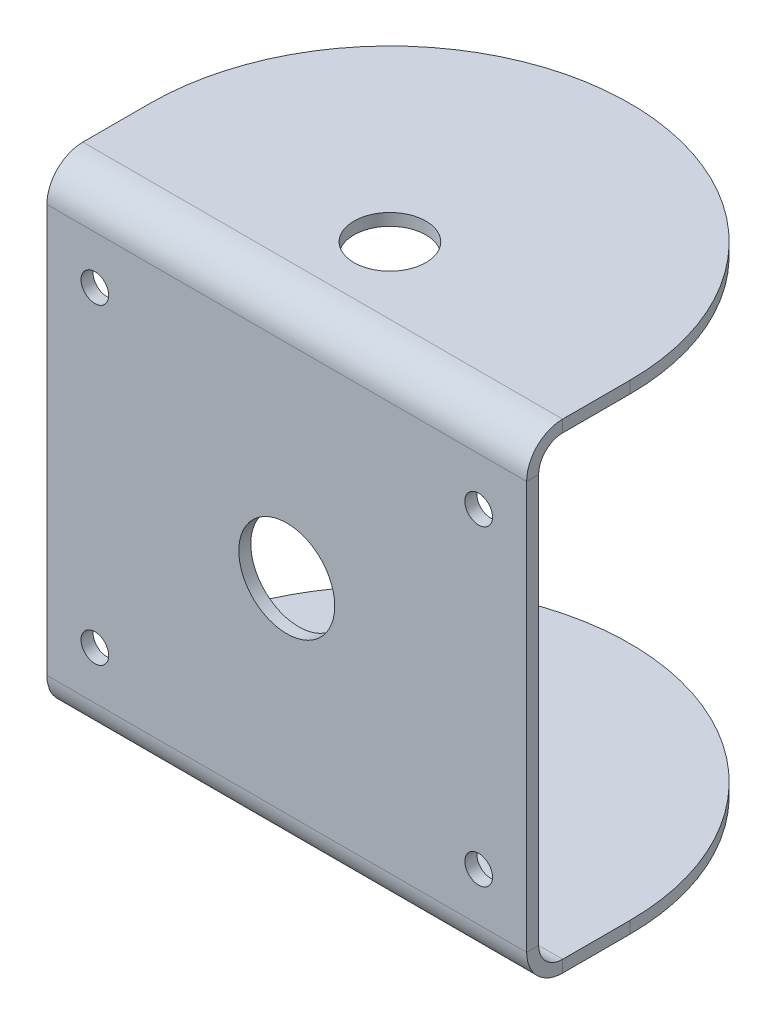
ISO-10303-21;
HEADER;
FILE_DESCRIPTION(('STEP AP214'),'2;1');
FILE_NAME('part.step','',(''),(''),'','','');
FILE_SCHEMA(('AUTOMOTIVE_DESIGN { 1 0 10303 214 1 1 1 1 }'));
ENDSEC;
DATA;
#1=APPLICATION_CONTEXT('core data for automotive mechanical design processes');
#2=APPLICATION_PROTOCOL_DEFINITION('international standard','automotive_design',2000,#1);
#3=PRODUCT_CONTEXT('',#1,'mechanical');
#4=PRODUCT('Part','Part','',(#3));
#5=PRODUCT_RELATED_PRODUCT_CATEGORY('part','',(#4));
#6=PRODUCT_DEFINITION_FORMATION('','',#4);
#7=PRODUCT_DEFINITION_CONTEXT('part definition',#1,'design');
#8=PRODUCT_DEFINITION('design','',#6,#7);
#9=PRODUCT_DEFINITION_SHAPE('','',#8);
#10=(LENGTH_UNIT() NAMED_UNIT(*) SI_UNIT(.MILLI.,.METRE.));
#11=(NAMED_UNIT(*) PLANE_ANGLE_UNIT() SI_UNIT($,.RADIAN.));
#12=(NAMED_UNIT(*) SI_UNIT($,.STERADIAN.) SOLID_ANGLE_UNIT());
#13=UNCERTAINTY_MEASURE_WITH_UNIT(LENGTH_MEASURE(1.E-05),#10,'distance_accuracy_value','');
#14=(GEOMETRIC_REPRESENTATION_CONTEXT(3) GLOBAL_UNCERTAINTY_ASSIGNED_CONTEXT((#13)) GLOBAL_UNIT_ASSIGNED_CONTEXT((#10,
#11,#12)) REPRESENTATION_CONTEXT('',''));
#15=CARTESIAN_POINT('',(0.,0.,0.));
#16=DIRECTION('',(0.,0.,1.));
#17=DIRECTION('',(1.,0.,0.));
#18=AXIS2_PLACEMENT_3D('',#15,#16,#17);
#19=CARTESIAN_POINT('',(-31.75,-26.9875,21.11375));
#20=DIRECTION('',(-1.,0.,0.));
#21=DIRECTION('',(0.,0.,1.));
#22=AXIS2_PLACEMENT_3D('',#19,#20,#21);
#23=PLANE('',#22);
#24=DIRECTION('',(0.,0.,1.));
#25=VECTOR('',#24,1.);
#26=CARTESIAN_POINT('',(-31.75,-30.1625,-22.70125));
#27=LINE('',#26,#25);
#28=CARTESIAN_POINT('',(-31.75,-30.1625,9.04875000000001));
#29=VERTEX_POINT('',#28);
#30=CARTESIAN_POINT('',(-31.75,-30.1625,17.93875));
#31=VERTEX_POINT('',#30);
#32=EDGE_CURVE('E170',#29,#31,#27,.T.);
#33=ORIENTED_EDGE('',*,*,#32,.F.);
#34=DIRECTION('',(0.,1.,0.));
#35=VECTOR('',#34,1.);
#36=CARTESIAN_POINT('',(-31.75,-95.25,9.04875000000001));
#37=LINE('',#36,#35);
#38=CARTESIAN_POINT('',(-31.75,-31.75,9.04875000000001));
#39=VERTEX_POINT('',#38);
#40=EDGE_CURVE('E148',#39,#29,#37,.T.);
#41=ORIENTED_EDGE('',*,*,#40,.F.);
#42=DIRECTION('',(0.,0.,1.));
#43=VECTOR('',#42,1.);
#44=CARTESIAN_POINT('',(-31.75,-31.75,-22.70125));
#45=LINE('',#44,#43);
#46=CARTESIAN_POINT('',(-31.75,-31.75,17.93875));
#47=VERTEX_POINT('',#46);
#48=EDGE_CURVE('E168',#39,#47,#45,.T.);
#49=ORIENTED_EDGE('',*,*,#48,.T.);
#50=DIRECTION('',(0.,1.,0.));
#51=VECTOR('',#50,1.);
#52=CARTESIAN_POINT('',(-31.75,-31.75,17.93875));
#53=LINE('',#52,#51);
#54=EDGE_CURVE('E215',#47,#31,#53,.T.);
#55=ORIENTED_EDGE('',*,*,#54,.T.);
#56=EDGE_LOOP('',(#33,#41,#49,#55));
#57=FACE_BOUND('',#56,.T.);
#58=ADVANCED_FACE('F43',(#57),#23,.T.);
#59=CARTESIAN_POINT('',(31.75,30.1625,22.70125));
#60=DIRECTION('',(0.,1.,0.));
#61=DIRECTION('',(0.,0.,1.));
#62=AXIS2_PLACEMENT_3D('',#59,#60,#61);
#63=PLANE('',#62);
#64=DIRECTION('',(0.,0.,1.));
#65=VECTOR('',#64,1.);
#66=CARTESIAN_POINT('',(-31.75,30.1625,22.70125));
#67=LINE('',#66,#65);
#68=CARTESIAN_POINT('',(-31.75,30.1625,17.93875));
#69=VERTEX_POINT('',#68);
#70=CARTESIAN_POINT('',(-31.75,30.1625,9.04875000000001));
#71=VERTEX_POINT('',#70);
#72=EDGE_CURVE('E155',#69,#71,#67,.F.);
#73=ORIENTED_EDGE('',*,*,#72,.T.);
#74=CARTESIAN_POINT('',(0.,30.1625,9.04875000000001));
#75=DIRECTION('',(0.,1.,0.));
#76=DIRECTION('',(0.,0.,1.));
#77=AXIS2_PLACEMENT_3D('',#74,#75,#76);
#78=CIRCLE('',#77,31.75);
#79=CARTESIAN_POINT('',(31.75,30.1625,9.04875));
#80=VERTEX_POINT('',#79);
#81=EDGE_CURVE('E68',#71,#80,#78,.F.);
#82=ORIENTED_EDGE('',*,*,#81,.T.);
#83=DIRECTION('',(0.,0.,1.));
#84=VECTOR('',#83,1.);
#85=CARTESIAN_POINT('',(31.75,30.1625,22.70125));
#86=LINE('',#85,#84);
#87=CARTESIAN_POINT('',(31.75,30.1625,17.93875));
#88=VERTEX_POINT('',#87);
#89=EDGE_CURVE('E181',#88,#80,#86,.F.);
#90=ORIENTED_EDGE('',*,*,#89,.F.);
#91=DIRECTION('',(-1.,0.,0.));
#92=VECTOR('',#91,1.);
#93=CARTESIAN_POINT('',(31.75,30.1625,17.93875));
#94=LINE('',#93,#92);
#95=EDGE_CURVE('E182',#88,#69,#94,.T.);
#96=ORIENTED_EDGE('',*,*,#95,.T.);
#97=EDGE_LOOP('',(#73,#82,#90,#96));
#98=FACE_BOUND('',#97,.T.);
#99=CARTESIAN_POINT('',(0.,30.1625,9.04875000000001));
#100=DIRECTION('',(0.,1.,0.));
#101=DIRECTION('',(0.,0.,1.));
#102=AXIS2_PLACEMENT_3D('',#99,#100,#101);
#103=CIRCLE('',#102,4.7625);
#104=CARTESIAN_POINT('',(0.,30.1625,13.81125));
#105=VERTEX_POINT('',#104);
#106=EDGE_CURVE('E159',#105,#105,#103,.T.);
#107=ORIENTED_EDGE('',*,*,#106,.T.);
#108=EDGE_LOOP('',(#107));
#109=FACE_BOUND('',#108,.T.);
#110=ADVANCED_FACE('F302',(#98,#109),#63,.F.);
#111=CARTESIAN_POINT('',(31.75,31.75,22.70125));
#112=DIRECTION('',(0.,1.,0.));
#113=DIRECTION('',(0.,0.,1.));
#114=AXIS2_PLACEMENT_3D('',#111,#112,#113);
#115=PLANE('',#114);
#116=CARTESIAN_POINT('',(0.,31.75,9.04875000000001));
#117=DIRECTION('',(0.,-1.,0.));
#118=DIRECTION('',(0.,0.,1.));
#119=AXIS2_PLACEMENT_3D('',#116,#117,#118);
#120=CIRCLE('',#119,31.75);
#121=CARTESIAN_POINT('',(-31.75,31.75,9.04875000000001));
#122=VERTEX_POINT('',#121);
#123=CARTESIAN_POINT('',(31.75,31.75,9.04875));
#124=VERTEX_POINT('',#123);
#125=EDGE_CURVE('E132',#122,#124,#120,.T.);
#126=ORIENTED_EDGE('',*,*,#125,.F.);
#127=DIRECTION('',(0.,0.,-1.));
#128=VECTOR('',#127,1.);
#129=CARTESIAN_POINT('',(-31.75,31.75,22.70125));
#130=LINE('',#129,#128);
#131=CARTESIAN_POINT('',(-31.75,31.75,17.93875));
#132=VERTEX_POINT('',#131);
#133=EDGE_CURVE('E144',#132,#122,#130,.T.);
#134=ORIENTED_EDGE('',*,*,#133,.F.);
#135=DIRECTION('',(-1.,0.,0.));
#136=VECTOR('',#135,1.);
#137=CARTESIAN_POINT('',(31.75,31.75,17.93875));
#138=LINE('',#137,#136);
#139=CARTESIAN_POINT('',(31.75,31.75,17.93875));
#140=VERTEX_POINT('',#139);
#141=EDGE_CURVE('E204',#140,#132,#138,.T.);
#142=ORIENTED_EDGE('',*,*,#141,.F.);
#143=DIRECTION('',(0.,0.,-1.));
#144=VECTOR('',#143,1.);
#145=CARTESIAN_POINT('',(31.75,31.75,22.70125));
#146=LINE('',#145,#144);
#147=EDGE_CURVE('E147',#140,#124,#146,.T.);
#148=ORIENTED_EDGE('',*,*,#147,.T.);
#149=EDGE_LOOP('',(#126,#134,#142,#148));
#150=FACE_BOUND('',#149,.T.);
#151=CARTESIAN_POINT('',(0.,31.75,9.04875000000001));
#152=DIRECTION('',(0.,1.,0.));
#153=DIRECTION('',(0.,0.,1.));
#154=AXIS2_PLACEMENT_3D('',#151,#152,#153);
#155=CIRCLE('',#154,4.7625);
#156=CARTESIAN_POINT('',(0.,31.75,13.81125));
#157=VERTEX_POINT('',#156);
#158=EDGE_CURVE('E149',#157,#157,#155,.T.);
#159=ORIENTED_EDGE('',*,*,#158,.F.);
#160=EDGE_LOOP('',(#159));
#161=FACE_BOUND('',#160,.T.);
#162=ADVANCED_FACE('F141',(#150,#161),#115,.T.);
#163=CARTESIAN_POINT('',(31.75,-31.75,-22.70125));
#164=DIRECTION('',(0.,-1.,0.));
#165=DIRECTION('',(0.,0.,-1.));
#166=AXIS2_PLACEMENT_3D('',#163,#164,#165);
#167=PLANE('',#166);
#168=ORIENTED_EDGE('',*,*,#48,.F.);
#169=CARTESIAN_POINT('',(0.,-31.75,9.04875000000001));
#170=DIRECTION('',(0.,-1.,0.));
#171=DIRECTION('',(0.,0.,-1.));
#172=AXIS2_PLACEMENT_3D('',#169,#170,#171);
#173=CIRCLE('',#172,31.75);
#174=CARTESIAN_POINT('',(31.75,-31.75,9.04875));
#175=VERTEX_POINT('',#174);
#176=EDGE_CURVE('E263',#175,#39,#173,.F.);
#177=ORIENTED_EDGE('',*,*,#176,.F.);
#178=DIRECTION('',(0.,0.,1.));
#179=VECTOR('',#178,1.);
#180=CARTESIAN_POINT('',(31.75,-31.75,-22.70125));
#181=LINE('',#180,#179);
#182=CARTESIAN_POINT('',(31.75,-31.75,17.93875));
#183=VERTEX_POINT('',#182);
#184=EDGE_CURVE('E282',#175,#183,#181,.T.);
#185=ORIENTED_EDGE('',*,*,#184,.T.);
#186=DIRECTION('',(-1.,0.,0.));
#187=VECTOR('',#186,1.);
#188=CARTESIAN_POINT('',(31.75,-31.75,17.93875));
#189=LINE('',#188,#187);
#190=EDGE_CURVE('E195',#183,#47,#189,.T.);
#191=ORIENTED_EDGE('',*,*,#190,.T.);
#192=EDGE_LOOP('',(#168,#177,#185,#191));
#193=FACE_BOUND('',#192,.T.);
#194=CARTESIAN_POINT('',(0.,-31.75,9.04875000000001));
#195=DIRECTION('',(0.,-1.,0.));
#196=DIRECTION('',(0.,0.,-1.));
#197=AXIS2_PLACEMENT_3D('',#194,#195,#196);
#198=CIRCLE('',#197,4.7625);
#199=CARTESIAN_POINT('',(0.,-31.75,4.28625000000001));
#200=VERTEX_POINT('',#199);
#201=EDGE_CURVE('E225',#200,#200,#198,.T.);
#202=ORIENTED_EDGE('',*,*,#201,.F.);
#203=EDGE_LOOP('',(#202));
#204=FACE_BOUND('',#203,.T.);
#205=ADVANCED_FACE('F346',(#193,#204),#167,.T.);
#206=CARTESIAN_POINT('',(31.75,-30.1625,-22.70125));
#207=DIRECTION('',(0.,-1.,0.));
#208=DIRECTION('',(0.,0.,-1.));
#209=AXIS2_PLACEMENT_3D('',#206,#207,#208);
#210=PLANE('',#209);
#211=DIRECTION('',(0.,0.,1.));
#212=VECTOR('',#211,1.);
#213=CARTESIAN_POINT('',(31.75,-30.1625,-22.70125));
#214=LINE('',#213,#212);
#215=CARTESIAN_POINT('',(31.75,-30.1625,9.04875000000001));
#216=VERTEX_POINT('',#215);
#217=CARTESIAN_POINT('',(31.75,-30.1625,17.93875));
#218=VERTEX_POINT('',#217);
#219=EDGE_CURVE('E284',#216,#218,#214,.T.);
#220=ORIENTED_EDGE('',*,*,#219,.F.);
#221=CARTESIAN_POINT('',(0.,-30.1625,9.04875000000001));
#222=DIRECTION('',(0.,-1.,0.));
#223=DIRECTION('',(0.,0.,-1.));
#224=AXIS2_PLACEMENT_3D('',#221,#222,#223);
#225=CIRCLE('',#224,31.75);
#226=EDGE_CURVE('E60',#216,#29,#225,.F.);
#227=ORIENTED_EDGE('',*,*,#226,.T.);
#228=ORIENTED_EDGE('',*,*,#32,.T.);
#229=DIRECTION('',(-1.,0.,0.));
#230=VECTOR('',#229,1.);
#231=CARTESIAN_POINT('',(31.75,-30.1625,17.93875));
#232=LINE('',#231,#230);
#233=EDGE_CURVE('E192',#218,#31,#232,.T.);
#234=ORIENTED_EDGE('',*,*,#233,.F.);
#235=EDGE_LOOP('',(#220,#227,#228,#234));
#236=FACE_BOUND('',#235,.T.);
#237=CARTESIAN_POINT('',(0.,-30.1625,9.04875000000001));
#238=DIRECTION('',(0.,-1.,0.));
#239=DIRECTION('',(0.,0.,-1.));
#240=AXIS2_PLACEMENT_3D('',#237,#238,#239);
#241=CIRCLE('',#240,4.7625);
#242=CARTESIAN_POINT('',(0.,-30.1625,4.28625000000001));
#243=VERTEX_POINT('',#242);
#244=EDGE_CURVE('E222',#243,#243,#241,.T.);
#245=ORIENTED_EDGE('',*,*,#244,.T.);
#246=EDGE_LOOP('',(#245));
#247=FACE_BOUND('',#246,.T.);
#248=ADVANCED_FACE('F354',(#236,#247),#210,.F.);
#249=CARTESIAN_POINT('',(31.75,-26.9875,22.70125));
#250=DIRECTION('',(1.,0.,0.));
#251=DIRECTION('',(0.,0.,-1.));
#252=AXIS2_PLACEMENT_3D('',#249,#250,#251);
#253=PLANE('',#252);
#254=DIRECTION('',(0.,0.,-1.));
#255=VECTOR('',#254,1.);
#256=CARTESIAN_POINT('',(31.75,-26.9875,22.70125));
#257=LINE('',#256,#255);
#258=CARTESIAN_POINT('',(31.75,-26.9875,22.70125));
#259=VERTEX_POINT('',#258);
#260=CARTESIAN_POINT('',(31.75,-26.9875,21.11375));
#261=VERTEX_POINT('',#260);
#262=EDGE_CURVE('E52',#259,#261,#257,.T.);
#263=ORIENTED_EDGE('',*,*,#262,.F.);
#264=CARTESIAN_POINT('',(31.75,-26.9875,17.93875));
#265=DIRECTION('',(1.,0.,0.));
#266=DIRECTION('',(0.,0.,-1.));
#267=AXIS2_PLACEMENT_3D('',#264,#265,#266);
#268=CIRCLE('',#267,4.7625);
#269=EDGE_CURVE('E279',#183,#259,#268,.F.);
#270=ORIENTED_EDGE('',*,*,#269,.F.);
#271=DIRECTION('',(0.,-1.,0.));
#272=VECTOR('',#271,1.);
#273=CARTESIAN_POINT('',(31.75,-30.1625,17.93875));
#274=LINE('',#273,#272);
#275=EDGE_CURVE('E218',#218,#183,#274,.T.);
#276=ORIENTED_EDGE('',*,*,#275,.F.);
#277=CARTESIAN_POINT('',(31.75,-26.9875,17.93875));
#278=DIRECTION('',(1.,0.,0.));
#279=DIRECTION('',(0.,1.,0.));
#280=AXIS2_PLACEMENT_3D('',#277,#278,#279);
#281=CIRCLE('',#280,3.175);
#282=EDGE_CURVE('E286',#218,#261,#281,.F.);
#283=ORIENTED_EDGE('',*,*,#282,.T.);
#284=EDGE_LOOP('',(#263,#270,#276,#283));
#285=FACE_BOUND('',#284,.T.);
#286=ADVANCED_FACE('F45',(#285),#253,.T.);
#287=CARTESIAN_POINT('',(31.75,-30.1625,17.93875));
#288=DIRECTION('',(1.,0.,0.));
#289=DIRECTION('',(0.,0.,-1.));
#290=AXIS2_PLACEMENT_3D('',#287,#288,#289);
#291=PLANE('',#290);
#292=DIRECTION('',(0.,1.,0.));
#293=VECTOR('',#292,1.);
#294=CARTESIAN_POINT('',(31.75,-31.75,22.70125));
#295=LINE('',#294,#293);
#296=CARTESIAN_POINT('',(31.75,26.9875,22.70125));
#297=VERTEX_POINT('',#296);
#298=EDGE_CURVE('E276',#259,#297,#295,.T.);
#299=ORIENTED_EDGE('',*,*,#298,.F.);
#300=ORIENTED_EDGE('',*,*,#262,.T.);
#301=DIRECTION('',(0.,1.,0.));
#302=VECTOR('',#301,1.);
#303=CARTESIAN_POINT('',(31.75,-31.75,21.11375));
#304=LINE('',#303,#302);
#305=CARTESIAN_POINT('',(31.75,26.9875,21.11375));
#306=VERTEX_POINT('',#305);
#307=EDGE_CURVE('E289',#261,#306,#304,.T.);
#308=ORIENTED_EDGE('',*,*,#307,.T.);
#309=DIRECTION('',(0.,0.,1.));
#310=VECTOR('',#309,1.);
#311=CARTESIAN_POINT('',(31.75,26.9875,21.11375));
#312=LINE('',#311,#310);
#313=EDGE_CURVE('E209',#306,#297,#312,.T.);
#314=ORIENTED_EDGE('',*,*,#313,.T.);
#315=EDGE_LOOP('',(#299,#300,#308,#314));
#316=FACE_BOUND('',#315,.T.);
#317=ADVANCED_FACE('F316',(#316),#291,.T.);
#318=CARTESIAN_POINT('',(-31.75,-31.75,17.93875));
#319=DIRECTION('',(-1.,0.,0.));
#320=DIRECTION('',(0.,0.,1.));
#321=AXIS2_PLACEMENT_3D('',#318,#319,#320);
#322=PLANE('',#321);
#323=ORIENTED_EDGE('',*,*,#54,.F.);
#324=CARTESIAN_POINT('',(-31.75,-26.9875,17.93875));
#325=DIRECTION('',(1.,0.,0.));
#326=DIRECTION('',(0.,0.,-1.));
#327=AXIS2_PLACEMENT_3D('',#324,#325,#326);
#328=CIRCLE('',#327,4.7625);
#329=CARTESIAN_POINT('',(-31.75,-26.9875,22.70125));
#330=VERTEX_POINT('',#329);
#331=EDGE_CURVE('E165',#47,#330,#328,.F.);
#332=ORIENTED_EDGE('',*,*,#331,.T.);
#333=DIRECTION('',(0.,0.,1.));
#334=VECTOR('',#333,1.);
#335=CARTESIAN_POINT('',(-31.75,-26.9875,21.11375));
#336=LINE('',#335,#334);
#337=CARTESIAN_POINT('',(-31.75,-26.9875,21.11375));
#338=VERTEX_POINT('',#337);
#339=EDGE_CURVE('E213',#338,#330,#336,.T.);
#340=ORIENTED_EDGE('',*,*,#339,.F.);
#341=CARTESIAN_POINT('',(-31.75,-26.9875,17.93875));
#342=DIRECTION('',(1.,0.,0.));
#343=DIRECTION('',(0.,1.,0.));
#344=AXIS2_PLACEMENT_3D('',#341,#342,#343);
#345=CIRCLE('',#344,3.175);
#346=EDGE_CURVE('E172',#31,#338,#345,.F.);
#347=ORIENTED_EDGE('',*,*,#346,.F.);
#348=EDGE_LOOP('',(#323,#332,#340,#347));
#349=FACE_BOUND('',#348,.T.);
#350=ADVANCED_FACE('F341',(#349),#322,.T.);
#351=CARTESIAN_POINT('',(31.75,31.75,17.93875));
#352=DIRECTION('',(1.,0.,0.));
#353=DIRECTION('',(0.,0.,-1.));
#354=AXIS2_PLACEMENT_3D('',#351,#352,#353);
#355=PLANE('',#354);
#356=DIRECTION('',(0.,-1.,0.));
#357=VECTOR('',#356,1.);
#358=CARTESIAN_POINT('',(31.75,31.75,17.93875));
#359=LINE('',#358,#357);
#360=EDGE_CURVE('E211',#140,#88,#359,.T.);
#361=ORIENTED_EDGE('',*,*,#360,.F.);
#362=CARTESIAN_POINT('',(31.75,26.9875,17.93875));
#363=DIRECTION('',(1.,0.,0.));
#364=DIRECTION('',(0.,0.,-1.));
#365=AXIS2_PLACEMENT_3D('',#362,#363,#364);
#366=CIRCLE('',#365,4.7625);
#367=EDGE_CURVE('E273',#297,#140,#366,.F.);
#368=ORIENTED_EDGE('',*,*,#367,.F.);
#369=ORIENTED_EDGE('',*,*,#313,.F.);
#370=CARTESIAN_POINT('',(31.75,26.9875,17.93875));
#371=DIRECTION('',(1.,0.,0.));
#372=DIRECTION('',(0.,1.,0.));
#373=AXIS2_PLACEMENT_3D('',#370,#371,#372);
#374=CIRCLE('',#373,3.175);
#375=EDGE_CURVE('E186',#306,#88,#374,.F.);
#376=ORIENTED_EDGE('',*,*,#375,.T.);
#377=EDGE_LOOP('',(#361,#368,#369,#376));
#378=FACE_BOUND('',#377,.T.);
#379=ADVANCED_FACE('F295',(#378),#355,.T.);
#380=CARTESIAN_POINT('',(31.75,26.9875,21.11375));
#381=DIRECTION('',(1.,0.,0.));
#382=DIRECTION('',(0.,0.,-1.));
#383=AXIS2_PLACEMENT_3D('',#380,#381,#382);
#384=PLANE('',#383);
#385=DIRECTION('',(0.,1.,0.));
#386=VECTOR('',#385,1.);
#387=CARTESIAN_POINT('',(31.75,-95.25,9.04875));
#388=LINE('',#387,#386);
#389=EDGE_CURVE('E258',#80,#124,#388,.T.);
#390=ORIENTED_EDGE('',*,*,#389,.T.);
#391=ORIENTED_EDGE('',*,*,#147,.F.);
#392=ORIENTED_EDGE('',*,*,#360,.T.);
#393=ORIENTED_EDGE('',*,*,#89,.T.);
#394=EDGE_LOOP('',(#390,#391,#392,#393));
#395=FACE_BOUND('',#394,.T.);
#396=ADVANCED_FACE('F305',(#395),#384,.T.);
#397=CARTESIAN_POINT('',(-31.75,26.9875,22.70125));
#398=DIRECTION('',(-1.,0.,0.));
#399=DIRECTION('',(0.,0.,1.));
#400=AXIS2_PLACEMENT_3D('',#397,#398,#399);
#401=PLANE('',#400);
#402=DIRECTION('',(0.,0.,-1.));
#403=VECTOR('',#402,1.);
#404=CARTESIAN_POINT('',(-31.75,26.9875,22.70125));
#405=LINE('',#404,#403);
#406=CARTESIAN_POINT('',(-31.75,26.9875,22.70125));
#407=VERTEX_POINT('',#406);
#408=CARTESIAN_POINT('',(-31.75,26.9875,21.11375));
#409=VERTEX_POINT('',#408);
#410=EDGE_CURVE('E207',#407,#409,#405,.T.);
#411=ORIENTED_EDGE('',*,*,#410,.F.);
#412=CARTESIAN_POINT('',(-31.75,26.9875,17.93875));
#413=DIRECTION('',(1.,0.,0.));
#414=DIRECTION('',(0.,0.,-1.));
#415=AXIS2_PLACEMENT_3D('',#412,#413,#414);
#416=CIRCLE('',#415,4.7625);
#417=EDGE_CURVE('E154',#407,#132,#416,.F.);
#418=ORIENTED_EDGE('',*,*,#417,.T.);
#419=DIRECTION('',(0.,1.,0.));
#420=VECTOR('',#419,1.);
#421=CARTESIAN_POINT('',(-31.75,30.1625,17.93875));
#422=LINE('',#421,#420);
#423=EDGE_CURVE('E152',#69,#132,#422,.T.);
#424=ORIENTED_EDGE('',*,*,#423,.F.);
#425=CARTESIAN_POINT('',(-31.75,26.9875,17.93875));
#426=DIRECTION('',(1.,0.,0.));
#427=DIRECTION('',(0.,1.,0.));
#428=AXIS2_PLACEMENT_3D('',#425,#426,#427);
#429=CIRCLE('',#428,3.175);
#430=EDGE_CURVE('E178',#409,#69,#429,.F.);
#431=ORIENTED_EDGE('',*,*,#430,.F.);
#432=EDGE_LOOP('',(#411,#418,#424,#431));
#433=FACE_BOUND('',#432,.T.);
#434=ADVANCED_FACE('F336',(#433),#401,.T.);
#435=CARTESIAN_POINT('',(-31.75,30.1625,17.93875));
#436=DIRECTION('',(-1.,0.,0.));
#437=DIRECTION('',(0.,0.,1.));
#438=AXIS2_PLACEMENT_3D('',#435,#436,#437);
#439=PLANE('',#438);
#440=DIRECTION('',(0.,1.,0.));
#441=VECTOR('',#440,1.);
#442=CARTESIAN_POINT('',(-31.75,-31.75,22.70125));
#443=LINE('',#442,#441);
#444=EDGE_CURVE('E157',#330,#407,#443,.T.);
#445=ORIENTED_EDGE('',*,*,#444,.T.);
#446=ORIENTED_EDGE('',*,*,#410,.T.);
#447=DIRECTION('',(0.,1.,0.));
#448=VECTOR('',#447,1.);
#449=CARTESIAN_POINT('',(-31.75,-31.75,21.11375));
#450=LINE('',#449,#448);
#451=EDGE_CURVE('E175',#338,#409,#450,.T.);
#452=ORIENTED_EDGE('',*,*,#451,.F.);
#453=ORIENTED_EDGE('',*,*,#339,.T.);
#454=EDGE_LOOP('',(#445,#446,#452,#453));
#455=FACE_BOUND('',#454,.T.);
#456=ADVANCED_FACE('F338',(#455),#439,.T.);
#457=CARTESIAN_POINT('',(31.75,26.9875,17.93875));
#458=DIRECTION('',(-1.,0.,0.));
#459=DIRECTION('',(0.,0.,1.));
#460=AXIS2_PLACEMENT_3D('',#457,#458,#459);
#461=CYLINDRICAL_SURFACE('',#460,4.7625);
#462=ORIENTED_EDGE('',*,*,#417,.F.);
#463=DIRECTION('',(-1.,0.,0.));
#464=VECTOR('',#463,1.);
#465=CARTESIAN_POINT('',(31.75,26.9875,22.70125));
#466=LINE('',#465,#464);
#467=EDGE_CURVE('E201',#297,#407,#466,.T.);
#468=ORIENTED_EDGE('',*,*,#467,.F.);
#469=ORIENTED_EDGE('',*,*,#367,.T.);
#470=ORIENTED_EDGE('',*,*,#141,.T.);
#471=EDGE_LOOP('',(#462,#468,#469,#470));
#472=FACE_BOUND('',#471,.T.);
#473=ADVANCED_FACE('F309',(#472),#461,.T.);
#474=CARTESIAN_POINT('',(31.75,-31.75,22.70125));
#475=DIRECTION('',(0.,0.,1.));
#476=DIRECTION('',(1.,0.,0.));
#477=AXIS2_PLACEMENT_3D('',#474,#475,#476);
#478=PLANE('',#477);
#479=CARTESIAN_POINT('',(0.,0.,22.70125));
#480=DIRECTION('',(0.,0.,1.));
#481=DIRECTION('',(1.,0.,0.));
#482=AXIS2_PLACEMENT_3D('',#479,#480,#481);
#483=CIRCLE('',#482,6.35);
#484=CARTESIAN_POINT('',(6.35,0.,22.70125));
#485=VERTEX_POINT('',#484);
#486=EDGE_CURVE('E246',#485,#485,#483,.T.);
#487=ORIENTED_EDGE('',*,*,#486,.F.);
#488=EDGE_LOOP('',(#487));
#489=FACE_BOUND('',#488,.T.);
#490=CARTESIAN_POINT('',(-25.4,20.6375,22.70125));
#491=DIRECTION('',(0.,0.,1.));
#492=DIRECTION('',(1.,0.,0.));
#493=AXIS2_PLACEMENT_3D('',#490,#491,#492);
#494=CIRCLE('',#493,1.82879999999999);
#495=CARTESIAN_POINT('',(-23.5712,20.6375,22.70125));
#496=VERTEX_POINT('',#495);
#497=EDGE_CURVE('E236',#496,#496,#494,.T.);
#498=ORIENTED_EDGE('',*,*,#497,.F.);
#499=EDGE_LOOP('',(#498));
#500=FACE_BOUND('',#499,.T.);
#501=CARTESIAN_POINT('',(25.4,20.6375,22.70125));
#502=DIRECTION('',(0.,0.,1.));
#503=DIRECTION('',(1.,0.,0.));
#504=AXIS2_PLACEMENT_3D('',#501,#502,#503);
#505=CIRCLE('',#504,1.82879999999999);
#506=CARTESIAN_POINT('',(27.2288,20.6375,22.70125));
#507=VERTEX_POINT('',#506);
#508=EDGE_CURVE('E233',#507,#507,#505,.T.);
#509=ORIENTED_EDGE('',*,*,#508,.F.);
#510=EDGE_LOOP('',(#509));
#511=FACE_BOUND('',#510,.T.);
#512=CARTESIAN_POINT('',(25.4,-20.6375,22.70125));
#513=DIRECTION('',(0.,0.,1.));
#514=DIRECTION('',(1.,0.,0.));
#515=AXIS2_PLACEMENT_3D('',#512,#513,#514);
#516=CIRCLE('',#515,1.82879999999999);
#517=CARTESIAN_POINT('',(27.2288,-20.6375,22.70125));
#518=VERTEX_POINT('',#517);
#519=EDGE_CURVE('E230',#518,#518,#516,.T.);
#520=ORIENTED_EDGE('',*,*,#519,.F.);
#521=EDGE_LOOP('',(#520));
#522=FACE_BOUND('',#521,.T.);
#523=CARTESIAN_POINT('',(-25.4,-20.6375,22.70125));
#524=DIRECTION('',(0.,0.,1.));
#525=DIRECTION('',(1.,0.,0.));
#526=AXIS2_PLACEMENT_3D('',#523,#524,#525);
#527=CIRCLE('',#526,1.82879999999999);
#528=CARTESIAN_POINT('',(-23.5712,-20.6375,22.70125));
#529=VERTEX_POINT('',#528);
#530=EDGE_CURVE('E229',#529,#529,#527,.T.);
#531=ORIENTED_EDGE('',*,*,#530,.F.);
#532=EDGE_LOOP('',(#531));
#533=FACE_BOUND('',#532,.T.);
#534=ORIENTED_EDGE('',*,*,#444,.F.);
#535=DIRECTION('',(-1.,0.,0.));
#536=VECTOR('',#535,1.);
#537=CARTESIAN_POINT('',(31.75,-26.9875,22.70125));
#538=LINE('',#537,#536);
#539=EDGE_CURVE('E198',#259,#330,#538,.T.);
#540=ORIENTED_EDGE('',*,*,#539,.F.);
#541=ORIENTED_EDGE('',*,*,#298,.T.);
#542=ORIENTED_EDGE('',*,*,#467,.T.);
#543=EDGE_LOOP('',(#534,#540,#541,#542));
#544=FACE_BOUND('',#543,.T.);
#545=ADVANCED_FACE('F314',(#489,#500,#511,#522,#533,#544),#478,.T.);
#546=CARTESIAN_POINT('',(31.75,-26.9875,17.93875));
#547=DIRECTION('',(-1.,0.,0.));
#548=DIRECTION('',(0.,0.,1.));
#549=AXIS2_PLACEMENT_3D('',#546,#547,#548);
#550=CYLINDRICAL_SURFACE('',#549,4.7625);
#551=ORIENTED_EDGE('',*,*,#331,.F.);
#552=ORIENTED_EDGE('',*,*,#190,.F.);
#553=ORIENTED_EDGE('',*,*,#269,.T.);
#554=ORIENTED_EDGE('',*,*,#539,.T.);
#555=EDGE_LOOP('',(#551,#552,#553,#554));
#556=FACE_BOUND('',#555,.T.);
#557=ADVANCED_FACE('F321',(#556),#550,.T.);
#558=CARTESIAN_POINT('',(31.75,-26.9875,17.93875));
#559=DIRECTION('',(-1.,0.,0.));
#560=DIRECTION('',(0.,0.,1.));
#561=AXIS2_PLACEMENT_3D('',#558,#559,#560);
#562=CYLINDRICAL_SURFACE('',#561,3.175);
#563=ORIENTED_EDGE('',*,*,#346,.T.);
#564=DIRECTION('',(-1.,0.,0.));
#565=VECTOR('',#564,1.);
#566=CARTESIAN_POINT('',(31.75,-26.9875,21.11375));
#567=LINE('',#566,#565);
#568=EDGE_CURVE('E189',#261,#338,#567,.T.);
#569=ORIENTED_EDGE('',*,*,#568,.F.);
#570=ORIENTED_EDGE('',*,*,#282,.F.);
#571=ORIENTED_EDGE('',*,*,#233,.T.);
#572=EDGE_LOOP('',(#563,#569,#570,#571));
#573=FACE_BOUND('',#572,.T.);
#574=ADVANCED_FACE('F329',(#573),#562,.F.);
#575=CARTESIAN_POINT('',(31.75,-31.75,21.11375));
#576=DIRECTION('',(0.,0.,1.));
#577=DIRECTION('',(1.,0.,0.));
#578=AXIS2_PLACEMENT_3D('',#575,#576,#577);
#579=PLANE('',#578);
#580=CARTESIAN_POINT('',(0.,0.,21.11375));
#581=DIRECTION('',(0.,0.,1.));
#582=DIRECTION('',(1.,0.,0.));
#583=AXIS2_PLACEMENT_3D('',#580,#581,#582);
#584=CIRCLE('',#583,6.35);
#585=CARTESIAN_POINT('',(6.35,0.,21.11375));
#586=VERTEX_POINT('',#585);
#587=EDGE_CURVE('E47',#586,#586,#584,.T.);
#588=ORIENTED_EDGE('',*,*,#587,.T.);
#589=EDGE_LOOP('',(#588));
#590=FACE_BOUND('',#589,.T.);
#591=CARTESIAN_POINT('',(-25.4,20.6375,21.11375));
#592=DIRECTION('',(0.,0.,1.));
#593=DIRECTION('',(1.,0.,0.));
#594=AXIS2_PLACEMENT_3D('',#591,#592,#593);
#595=CIRCLE('',#594,1.82879999999999);
#596=CARTESIAN_POINT('',(-23.5712,20.6375,21.11375));
#597=VERTEX_POINT('',#596);
#598=EDGE_CURVE('E234',#597,#597,#595,.T.);
#599=ORIENTED_EDGE('',*,*,#598,.T.);
#600=EDGE_LOOP('',(#599));
#601=FACE_BOUND('',#600,.T.);
#602=CARTESIAN_POINT('',(25.4,20.6375,21.11375));
#603=DIRECTION('',(0.,0.,1.));
#604=DIRECTION('',(1.,0.,0.));
#605=AXIS2_PLACEMENT_3D('',#602,#603,#604);
#606=CIRCLE('',#605,1.82879999999999);
#607=CARTESIAN_POINT('',(27.2288,20.6375,21.11375));
#608=VERTEX_POINT('',#607);
#609=EDGE_CURVE('E231',#608,#608,#606,.T.);
#610=ORIENTED_EDGE('',*,*,#609,.T.);
#611=EDGE_LOOP('',(#610));
#612=FACE_BOUND('',#611,.T.);
#613=CARTESIAN_POINT('',(25.4,-20.6375,21.11375));
#614=DIRECTION('',(0.,0.,1.));
#615=DIRECTION('',(1.,0.,0.));
#616=AXIS2_PLACEMENT_3D('',#613,#614,#615);
#617=CIRCLE('',#616,1.82879999999999);
#618=CARTESIAN_POINT('',(27.2288,-20.6375,21.11375));
#619=VERTEX_POINT('',#618);
#620=EDGE_CURVE('E226',#619,#619,#617,.T.);
#621=ORIENTED_EDGE('',*,*,#620,.T.);
#622=EDGE_LOOP('',(#621));
#623=FACE_BOUND('',#622,.T.);
#624=CARTESIAN_POINT('',(-25.4,-20.6375,21.11375));
#625=DIRECTION('',(0.,0.,1.));
#626=DIRECTION('',(1.,0.,0.));
#627=AXIS2_PLACEMENT_3D('',#624,#625,#626);
#628=CIRCLE('',#627,1.82879999999999);
#629=CARTESIAN_POINT('',(-23.5712,-20.6375,21.11375));
#630=VERTEX_POINT('',#629);
#631=EDGE_CURVE('E253',#630,#630,#628,.T.);
#632=ORIENTED_EDGE('',*,*,#631,.T.);
#633=EDGE_LOOP('',(#632));
#634=FACE_BOUND('',#633,.T.);
#635=ORIENTED_EDGE('',*,*,#451,.T.);
#636=DIRECTION('',(-1.,0.,0.));
#637=VECTOR('',#636,1.);
#638=CARTESIAN_POINT('',(31.75,26.9875,21.11375));
#639=LINE('',#638,#637);
#640=EDGE_CURVE('E185',#306,#409,#639,.T.);
#641=ORIENTED_EDGE('',*,*,#640,.F.);
#642=ORIENTED_EDGE('',*,*,#307,.F.);
#643=ORIENTED_EDGE('',*,*,#568,.T.);
#644=EDGE_LOOP('',(#635,#641,#642,#643));
#645=FACE_BOUND('',#644,.T.);
#646=ADVANCED_FACE('F334',(#590,#601,#612,#623,#634,#645),#579,.F.);
#647=CARTESIAN_POINT('',(31.75,26.9875,17.93875));
#648=DIRECTION('',(-1.,0.,0.));
#649=DIRECTION('',(0.,0.,1.));
#650=AXIS2_PLACEMENT_3D('',#647,#648,#649);
#651=CYLINDRICAL_SURFACE('',#650,3.175);
#652=ORIENTED_EDGE('',*,*,#430,.T.);
#653=ORIENTED_EDGE('',*,*,#95,.F.);
#654=ORIENTED_EDGE('',*,*,#375,.F.);
#655=ORIENTED_EDGE('',*,*,#640,.T.);
#656=EDGE_LOOP('',(#652,#653,#654,#655));
#657=FACE_BOUND('',#656,.T.);
#658=ADVANCED_FACE('F299',(#657),#651,.F.);
#659=CARTESIAN_POINT('',(31.75,26.9875,17.93875));
#660=DIRECTION('',(1.,0.,0.));
#661=DIRECTION('',(0.,1.,0.));
#662=AXIS2_PLACEMENT_3D('',#659,#660,#661);
#663=PLANE('',#662);
#664=EDGE_CURVE('E260',#175,#216,#388,.T.);
#665=ORIENTED_EDGE('',*,*,#664,.T.);
#666=ORIENTED_EDGE('',*,*,#219,.T.);
#667=ORIENTED_EDGE('',*,*,#275,.T.);
#668=ORIENTED_EDGE('',*,*,#184,.F.);
#669=EDGE_LOOP('',(#665,#666,#667,#668));
#670=FACE_BOUND('',#669,.T.);
#671=ADVANCED_FACE('F351',(#670),#663,.T.);
#672=CARTESIAN_POINT('',(-31.75,26.9875,17.93875));
#673=DIRECTION('',(1.,0.,0.));
#674=DIRECTION('',(0.,1.,0.));
#675=AXIS2_PLACEMENT_3D('',#672,#673,#674);
#676=PLANE('',#675);
#677=ORIENTED_EDGE('',*,*,#133,.T.);
#678=DIRECTION('',(0.,1.,0.));
#679=VECTOR('',#678,1.);
#680=CARTESIAN_POINT('',(-31.75,-95.25,9.04875000000001));
#681=LINE('',#680,#679);
#682=EDGE_CURVE('E11',#122,#71,#681,.F.);
#683=ORIENTED_EDGE('',*,*,#682,.T.);
#684=ORIENTED_EDGE('',*,*,#72,.F.);
#685=ORIENTED_EDGE('',*,*,#423,.T.);
#686=EDGE_LOOP('',(#677,#683,#684,#685));
#687=FACE_BOUND('',#686,.T.);
#688=ADVANCED_FACE('F151',(#687),#676,.F.);
#689=CARTESIAN_POINT('',(0.,-95.25,9.04875000000001));
#690=DIRECTION('',(0.,1.,0.));
#691=DIRECTION('',(0.,0.,1.));
#692=AXIS2_PLACEMENT_3D('',#689,#690,#691);
#693=CYLINDRICAL_SURFACE('',#692,31.75);
#694=ORIENTED_EDGE('',*,*,#682,.F.);
#695=ORIENTED_EDGE('',*,*,#125,.T.);
#696=ORIENTED_EDGE('',*,*,#389,.F.);
#697=ORIENTED_EDGE('',*,*,#81,.F.);
#698=EDGE_LOOP('',(#694,#695,#696,#697));
#699=FACE_BOUND('',#698,.T.);
#700=ADVANCED_FACE('F131',(#699),#693,.T.);
#701=ORIENTED_EDGE('',*,*,#176,.T.);
#702=ORIENTED_EDGE('',*,*,#40,.T.);
#703=ORIENTED_EDGE('',*,*,#226,.F.);
#704=ORIENTED_EDGE('',*,*,#664,.F.);
#705=EDGE_LOOP('',(#701,#702,#703,#704));
#706=FACE_BOUND('',#705,.T.);
#707=ADVANCED_FACE('F357',(#706),#693,.T.);
#708=CARTESIAN_POINT('',(0.,-95.25,9.04875000000001));
#709=DIRECTION('',(0.,1.,0.));
#710=DIRECTION('',(0.,0.,1.));
#711=AXIS2_PLACEMENT_3D('',#708,#709,#710);
#712=CYLINDRICAL_SURFACE('',#711,4.7625);
#713=ORIENTED_EDGE('',*,*,#201,.T.);
#714=EDGE_LOOP('',(#713));
#715=FACE_BOUND('',#714,.T.);
#716=ORIENTED_EDGE('',*,*,#244,.F.);
#717=EDGE_LOOP('',(#716));
#718=FACE_BOUND('',#717,.T.);
#719=ADVANCED_FACE('F359',(#715,#718),#712,.F.);
#720=ORIENTED_EDGE('',*,*,#158,.T.);
#721=EDGE_LOOP('',(#720));
#722=FACE_BOUND('',#721,.T.);
#723=ORIENTED_EDGE('',*,*,#106,.F.);
#724=EDGE_LOOP('',(#723));
#725=FACE_BOUND('',#724,.T.);
#726=ADVANCED_FACE('F365',(#722,#725),#712,.F.);
#727=CARTESIAN_POINT('',(-25.4,-20.6375,22.70125));
#728=DIRECTION('',(0.,0.,1.));
#729=DIRECTION('',(1.,0.,0.));
#730=AXIS2_PLACEMENT_3D('',#727,#728,#729);
#731=CYLINDRICAL_SURFACE('',#730,1.82879999999999);
#732=ORIENTED_EDGE('',*,*,#530,.T.);
#733=EDGE_LOOP('',(#732));
#734=FACE_BOUND('',#733,.T.);
#735=ORIENTED_EDGE('',*,*,#631,.F.);
#736=EDGE_LOOP('',(#735));
#737=FACE_BOUND('',#736,.T.);
#738=ADVANCED_FACE('F534',(#734,#737),#731,.F.);
#739=CARTESIAN_POINT('',(25.4,-20.6375,22.70125));
#740=DIRECTION('',(0.,0.,1.));
#741=DIRECTION('',(1.,0.,0.));
#742=AXIS2_PLACEMENT_3D('',#739,#740,#741);
#743=CYLINDRICAL_SURFACE('',#742,1.82879999999999);
#744=ORIENTED_EDGE('',*,*,#519,.T.);
#745=EDGE_LOOP('',(#744));
#746=FACE_BOUND('',#745,.T.);
#747=ORIENTED_EDGE('',*,*,#620,.F.);
#748=EDGE_LOOP('',(#747));
#749=FACE_BOUND('',#748,.T.);
#750=ADVANCED_FACE('F544',(#746,#749),#743,.F.);
#751=CARTESIAN_POINT('',(25.4,20.6375,22.70125));
#752=DIRECTION('',(0.,0.,1.));
#753=DIRECTION('',(1.,0.,0.));
#754=AXIS2_PLACEMENT_3D('',#751,#752,#753);
#755=CYLINDRICAL_SURFACE('',#754,1.82879999999999);
#756=ORIENTED_EDGE('',*,*,#508,.T.);
#757=EDGE_LOOP('',(#756));
#758=FACE_BOUND('',#757,.T.);
#759=ORIENTED_EDGE('',*,*,#609,.F.);
#760=EDGE_LOOP('',(#759));
#761=FACE_BOUND('',#760,.T.);
#762=ADVANCED_FACE('F554',(#758,#761),#755,.F.);
#763=CARTESIAN_POINT('',(-25.4,20.6375,22.70125));
#764=DIRECTION('',(0.,0.,1.));
#765=DIRECTION('',(1.,0.,0.));
#766=AXIS2_PLACEMENT_3D('',#763,#764,#765);
#767=CYLINDRICAL_SURFACE('',#766,1.82879999999999);
#768=ORIENTED_EDGE('',*,*,#497,.T.);
#769=EDGE_LOOP('',(#768));
#770=FACE_BOUND('',#769,.T.);
#771=ORIENTED_EDGE('',*,*,#598,.F.);
#772=EDGE_LOOP('',(#771));
#773=FACE_BOUND('',#772,.T.);
#774=ADVANCED_FACE('F564',(#770,#773),#767,.F.);
#775=CARTESIAN_POINT('',(0.,0.,20.16125));
#776=DIRECTION('',(0.,0.,1.));
#777=DIRECTION('',(1.,0.,0.));
#778=AXIS2_PLACEMENT_3D('',#775,#776,#777);
#779=CYLINDRICAL_SURFACE('',#778,6.35);
#780=ORIENTED_EDGE('',*,*,#486,.T.);
#781=EDGE_LOOP('',(#780));
#782=FACE_BOUND('',#781,.T.);
#783=ORIENTED_EDGE('',*,*,#587,.F.);
#784=EDGE_LOOP('',(#783));
#785=FACE_BOUND('',#784,.T.);
#786=ADVANCED_FACE('F574',(#782,#785),#779,.F.);
#787=CLOSED_SHELL('',(#58,#110,#162,#205,#248,#286,#317,#350,#379,#396,#434,#456,#473,#545,#557,
#574,#646,#658,#671,#688,#700,#707,#719,#726,#738,#750,#762,#774,#786));
#788=MANIFOLD_SOLID_BREP('B2',#787);
#789=ADVANCED_BREP_SHAPE_REPRESENTATION('',(#18,#788),#14);
#790=SHAPE_DEFINITION_REPRESENTATION(#9,#789);
ENDSEC;
END-ISO-10303-21;
